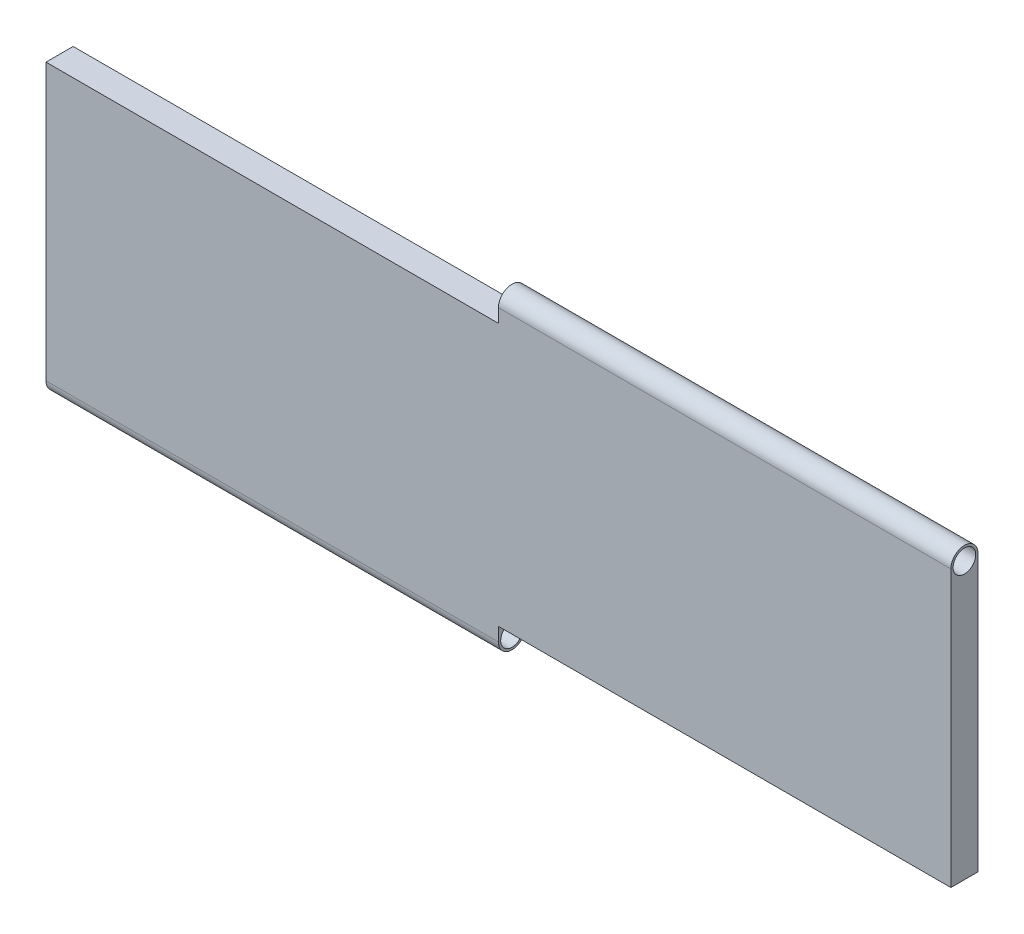
ISO-10303-21;
HEADER;
FILE_DESCRIPTION(('STEP AP214'),'2;1');
FILE_NAME('part.step','',(''),(''),'','','');
FILE_SCHEMA(('AUTOMOTIVE_DESIGN { 1 0 10303 214 1 1 1 1 }'));
ENDSEC;
DATA;
#1=APPLICATION_CONTEXT('core data for automotive mechanical design processes');
#2=APPLICATION_PROTOCOL_DEFINITION('international standard','automotive_design',2000,#1);
#3=PRODUCT_CONTEXT('',#1,'mechanical');
#4=PRODUCT('Part','Part','',(#3));
#5=PRODUCT_RELATED_PRODUCT_CATEGORY('part','',(#4));
#6=PRODUCT_DEFINITION_FORMATION('','',#4);
#7=PRODUCT_DEFINITION_CONTEXT('part definition',#1,'design');
#8=PRODUCT_DEFINITION('design','',#6,#7);
#9=PRODUCT_DEFINITION_SHAPE('','',#8);
#10=(LENGTH_UNIT() NAMED_UNIT(*) SI_UNIT(.MILLI.,.METRE.));
#11=(NAMED_UNIT(*) PLANE_ANGLE_UNIT() SI_UNIT($,.RADIAN.));
#12=(NAMED_UNIT(*) SI_UNIT($,.STERADIAN.) SOLID_ANGLE_UNIT());
#13=UNCERTAINTY_MEASURE_WITH_UNIT(LENGTH_MEASURE(1.E-05),#10,'distance_accuracy_value','');
#14=(GEOMETRIC_REPRESENTATION_CONTEXT(3) GLOBAL_UNCERTAINTY_ASSIGNED_CONTEXT((#13)) GLOBAL_UNIT_ASSIGNED_CONTEXT((#10,
#11,#12)) REPRESENTATION_CONTEXT('',''));
#15=CARTESIAN_POINT('',(0.,0.,0.));
#16=DIRECTION('',(0.,0.,1.));
#17=DIRECTION('',(1.,0.,0.));
#18=AXIS2_PLACEMENT_3D('',#15,#16,#17);
#19=CARTESIAN_POINT('',(-500.,-145.,30.));
#20=DIRECTION('',(0.,1.,0.));
#21=DIRECTION('',(0.,0.,1.));
#22=AXIS2_PLACEMENT_3D('',#19,#20,#21);
#23=PLANE('',#22);
#24=DIRECTION('',(0.,0.,1.));
#25=VECTOR('',#24,1.);
#26=CARTESIAN_POINT('',(0.,-145.,0.));
#27=LINE('',#26,#25);
#28=CARTESIAN_POINT('',(0.,-145.,0.));
#29=VERTEX_POINT('',#28);
#30=CARTESIAN_POINT('',(0.,-145.,30.));
#31=VERTEX_POINT('',#30);
#32=EDGE_CURVE('E51',#29,#31,#27,.T.);
#33=ORIENTED_EDGE('',*,*,#32,.F.);
#34=DIRECTION('',(1.,0.,0.));
#35=VECTOR('',#34,1.);
#36=CARTESIAN_POINT('',(-500.,-145.,0.));
#37=LINE('',#36,#35);
#38=CARTESIAN_POINT('',(500.,-145.,0.));
#39=VERTEX_POINT('',#38);
#40=EDGE_CURVE('E119',#29,#39,#37,.T.);
#41=ORIENTED_EDGE('',*,*,#40,.T.);
#42=DIRECTION('',(0.,0.,-1.));
#43=VECTOR('',#42,1.);
#44=CARTESIAN_POINT('',(500.,-145.,30.));
#45=LINE('',#44,#43);
#46=CARTESIAN_POINT('',(500.,-145.,30.));
#47=VERTEX_POINT('',#46);
#48=EDGE_CURVE('E44',#47,#39,#45,.T.);
#49=ORIENTED_EDGE('',*,*,#48,.F.);
#50=DIRECTION('',(1.,0.,0.));
#51=VECTOR('',#50,1.);
#52=CARTESIAN_POINT('',(-500.,-145.,30.));
#53=LINE('',#52,#51);
#54=EDGE_CURVE('E170',#31,#47,#53,.T.);
#55=ORIENTED_EDGE('',*,*,#54,.F.);
#56=EDGE_LOOP('',(#33,#41,#49,#55));
#57=FACE_BOUND('',#56,.T.);
#58=ADVANCED_FACE('F36',(#57),#23,.F.);
#59=CARTESIAN_POINT('',(-500.,145.,30.));
#60=DIRECTION('',(0.,-1.,0.));
#61=DIRECTION('',(0.,0.,-1.));
#62=AXIS2_PLACEMENT_3D('',#59,#60,#61);
#63=PLANE('',#62);
#64=DIRECTION('',(0.,0.,1.));
#65=VECTOR('',#64,1.);
#66=CARTESIAN_POINT('',(0.,145.,0.));
#67=LINE('',#66,#65);
#68=CARTESIAN_POINT('',(0.,145.,0.));
#69=VERTEX_POINT('',#68);
#70=CARTESIAN_POINT('',(0.,145.,30.));
#71=VERTEX_POINT('',#70);
#72=EDGE_CURVE('E59',#69,#71,#67,.T.);
#73=ORIENTED_EDGE('',*,*,#72,.F.);
#74=DIRECTION('',(-1.,0.,0.));
#75=VECTOR('',#74,1.);
#76=CARTESIAN_POINT('',(-500.,145.,0.));
#77=LINE('',#76,#75);
#78=CARTESIAN_POINT('',(-500.,145.,0.));
#79=VERTEX_POINT('',#78);
#80=EDGE_CURVE('E173',#69,#79,#77,.T.);
#81=ORIENTED_EDGE('',*,*,#80,.T.);
#82=DIRECTION('',(0.,0.,-1.));
#83=VECTOR('',#82,1.);
#84=CARTESIAN_POINT('',(-500.,145.,30.));
#85=LINE('',#84,#83);
#86=CARTESIAN_POINT('',(-500.,145.,30.));
#87=VERTEX_POINT('',#86);
#88=EDGE_CURVE('E11',#87,#79,#85,.T.);
#89=ORIENTED_EDGE('',*,*,#88,.F.);
#90=DIRECTION('',(-1.,0.,0.));
#91=VECTOR('',#90,1.);
#92=CARTESIAN_POINT('',(-500.,145.,30.));
#93=LINE('',#92,#91);
#94=EDGE_CURVE('E166',#71,#87,#93,.T.);
#95=ORIENTED_EDGE('',*,*,#94,.F.);
#96=EDGE_LOOP('',(#73,#81,#89,#95));
#97=FACE_BOUND('',#96,.T.);
#98=ADVANCED_FACE('F206',(#97),#63,.F.);
#99=CARTESIAN_POINT('',(500.,145.,30.));
#100=DIRECTION('',(-1.,0.,0.));
#101=DIRECTION('',(0.,0.,1.));
#102=AXIS2_PLACEMENT_3D('',#99,#100,#101);
#103=PLANE('',#102);
#104=DIRECTION('',(0.,1.,0.));
#105=VECTOR('',#104,1.);
#106=CARTESIAN_POINT('',(500.,145.,0.));
#107=LINE('',#106,#105);
#108=CARTESIAN_POINT('',(500.,160.,0.));
#109=VERTEX_POINT('',#108);
#110=EDGE_CURVE('E161',#39,#109,#107,.T.);
#111=ORIENTED_EDGE('',*,*,#110,.T.);
#112=CARTESIAN_POINT('',(500.,160.,15.));
#113=DIRECTION('',(1.,0.,0.));
#114=DIRECTION('',(0.,0.,-1.));
#115=AXIS2_PLACEMENT_3D('',#112,#113,#114);
#116=CIRCLE('',#115,15.);
#117=CARTESIAN_POINT('',(500.,160.,30.));
#118=VERTEX_POINT('',#117);
#119=EDGE_CURVE('E143',#109,#118,#116,.T.);
#120=ORIENTED_EDGE('',*,*,#119,.T.);
#121=DIRECTION('',(0.,1.,0.));
#122=VECTOR('',#121,1.);
#123=CARTESIAN_POINT('',(500.,145.,30.));
#124=LINE('',#123,#122);
#125=EDGE_CURVE('E164',#47,#118,#124,.T.);
#126=ORIENTED_EDGE('',*,*,#125,.F.);
#127=ORIENTED_EDGE('',*,*,#48,.T.);
#128=EDGE_LOOP('',(#111,#120,#126,#127));
#129=FACE_BOUND('',#128,.T.);
#130=CARTESIAN_POINT('',(500.,160.,15.));
#131=DIRECTION('',(1.,0.,0.));
#132=DIRECTION('',(0.,0.,-1.));
#133=AXIS2_PLACEMENT_3D('',#130,#131,#132);
#134=CIRCLE('',#133,12.5);
#135=CARTESIAN_POINT('',(500.,160.,2.5));
#136=VERTEX_POINT('',#135);
#137=EDGE_CURVE('E137',#136,#136,#134,.T.);
#138=ORIENTED_EDGE('',*,*,#137,.F.);
#139=EDGE_LOOP('',(#138));
#140=FACE_BOUND('',#139,.T.);
#141=ADVANCED_FACE('F38',(#129,#140),#103,.F.);
#142=CARTESIAN_POINT('',(-500.,145.,30.));
#143=DIRECTION('',(1.,0.,0.));
#144=DIRECTION('',(0.,0.,-1.));
#145=AXIS2_PLACEMENT_3D('',#142,#143,#144);
#146=PLANE('',#145);
#147=DIRECTION('',(0.,-1.,0.));
#148=VECTOR('',#147,1.);
#149=CARTESIAN_POINT('',(-500.,145.,0.));
#150=LINE('',#149,#148);
#151=CARTESIAN_POINT('',(-500.,-160.,0.));
#152=VERTEX_POINT('',#151);
#153=EDGE_CURVE('E175',#79,#152,#150,.T.);
#154=ORIENTED_EDGE('',*,*,#153,.T.);
#155=CARTESIAN_POINT('',(-500.,-160.,15.));
#156=DIRECTION('',(-1.,0.,0.));
#157=DIRECTION('',(0.,0.,1.));
#158=AXIS2_PLACEMENT_3D('',#155,#156,#157);
#159=CIRCLE('',#158,15.);
#160=CARTESIAN_POINT('',(-500.,-160.,30.));
#161=VERTEX_POINT('',#160);
#162=EDGE_CURVE('E109',#152,#161,#159,.T.);
#163=ORIENTED_EDGE('',*,*,#162,.T.);
#164=DIRECTION('',(0.,-1.,0.));
#165=VECTOR('',#164,1.);
#166=CARTESIAN_POINT('',(-500.,145.,30.));
#167=LINE('',#166,#165);
#168=EDGE_CURVE('E168',#87,#161,#167,.T.);
#169=ORIENTED_EDGE('',*,*,#168,.F.);
#170=ORIENTED_EDGE('',*,*,#88,.T.);
#171=EDGE_LOOP('',(#154,#163,#169,#170));
#172=FACE_BOUND('',#171,.T.);
#173=CARTESIAN_POINT('',(-500.,-160.,15.));
#174=DIRECTION('',(-1.,0.,0.));
#175=DIRECTION('',(0.,0.,1.));
#176=AXIS2_PLACEMENT_3D('',#173,#174,#175);
#177=CIRCLE('',#176,12.5);
#178=CARTESIAN_POINT('',(-500.,-160.,27.5));
#179=VERTEX_POINT('',#178);
#180=EDGE_CURVE('E121',#179,#179,#177,.T.);
#181=ORIENTED_EDGE('',*,*,#180,.F.);
#182=EDGE_LOOP('',(#181));
#183=FACE_BOUND('',#182,.T.);
#184=ADVANCED_FACE('F214',(#172,#183),#146,.F.);
#185=CARTESIAN_POINT('',(0.,0.,30.));
#186=DIRECTION('',(0.,0.,1.));
#187=DIRECTION('',(1.,0.,0.));
#188=AXIS2_PLACEMENT_3D('',#185,#186,#187);
#189=PLANE('',#188);
#190=ORIENTED_EDGE('',*,*,#125,.T.);
#191=DIRECTION('',(1.,0.,0.));
#192=VECTOR('',#191,1.);
#193=CARTESIAN_POINT('',(0.,160.,30.));
#194=LINE('',#193,#192);
#195=CARTESIAN_POINT('',(0.,160.,30.));
#196=VERTEX_POINT('',#195);
#197=EDGE_CURVE('E153',#196,#118,#194,.T.);
#198=ORIENTED_EDGE('',*,*,#197,.F.);
#199=DIRECTION('',(0.,-1.,0.));
#200=VECTOR('',#199,1.);
#201=CARTESIAN_POINT('',(0.,0.,29.9999999999999));
#202=LINE('',#201,#200);
#203=EDGE_CURVE('E146',#196,#71,#202,.T.);
#204=ORIENTED_EDGE('',*,*,#203,.T.);
#205=ORIENTED_EDGE('',*,*,#94,.T.);
#206=ORIENTED_EDGE('',*,*,#168,.T.);
#207=DIRECTION('',(-1.,0.,0.));
#208=VECTOR('',#207,1.);
#209=CARTESIAN_POINT('',(0.,-160.,30.));
#210=LINE('',#209,#208);
#211=CARTESIAN_POINT('',(0.,-160.,30.));
#212=VERTEX_POINT('',#211);
#213=EDGE_CURVE('E112',#212,#161,#210,.T.);
#214=ORIENTED_EDGE('',*,*,#213,.F.);
#215=DIRECTION('',(0.,1.,0.));
#216=VECTOR('',#215,1.);
#217=CARTESIAN_POINT('',(0.,0.,30.));
#218=LINE('',#217,#216);
#219=EDGE_CURVE('E127',#212,#31,#218,.T.);
#220=ORIENTED_EDGE('',*,*,#219,.T.);
#221=ORIENTED_EDGE('',*,*,#54,.T.);
#222=EDGE_LOOP('',(#190,#198,#204,#205,#206,#214,#220,#221));
#223=FACE_BOUND('',#222,.T.);
#224=ADVANCED_FACE('F189',(#223),#189,.T.);
#225=CARTESIAN_POINT('',(0.,0.,0.));
#226=DIRECTION('',(0.,0.,1.));
#227=DIRECTION('',(1.,0.,0.));
#228=AXIS2_PLACEMENT_3D('',#225,#226,#227);
#229=PLANE('',#228);
#230=ORIENTED_EDGE('',*,*,#110,.F.);
#231=ORIENTED_EDGE('',*,*,#40,.F.);
#232=DIRECTION('',(0.,1.,0.));
#233=VECTOR('',#232,1.);
#234=CARTESIAN_POINT('',(0.,0.,0.));
#235=LINE('',#234,#233);
#236=CARTESIAN_POINT('',(0.,-160.,0.));
#237=VERTEX_POINT('',#236);
#238=EDGE_CURVE('E116',#237,#29,#235,.T.);
#239=ORIENTED_EDGE('',*,*,#238,.F.);
#240=DIRECTION('',(-1.,0.,0.));
#241=VECTOR('',#240,1.);
#242=CARTESIAN_POINT('',(0.,-160.,0.));
#243=LINE('',#242,#241);
#244=EDGE_CURVE('E102',#237,#152,#243,.T.);
#245=ORIENTED_EDGE('',*,*,#244,.T.);
#246=ORIENTED_EDGE('',*,*,#153,.F.);
#247=ORIENTED_EDGE('',*,*,#80,.F.);
#248=DIRECTION('',(0.,-1.,0.));
#249=VECTOR('',#248,1.);
#250=CARTESIAN_POINT('',(0.,0.,0.));
#251=LINE('',#250,#249);
#252=CARTESIAN_POINT('',(0.,160.,0.));
#253=VERTEX_POINT('',#252);
#254=EDGE_CURVE('E150',#253,#69,#251,.T.);
#255=ORIENTED_EDGE('',*,*,#254,.F.);
#256=DIRECTION('',(1.,0.,0.));
#257=VECTOR('',#256,1.);
#258=CARTESIAN_POINT('',(0.,160.,0.));
#259=LINE('',#258,#257);
#260=EDGE_CURVE('E158',#253,#109,#259,.T.);
#261=ORIENTED_EDGE('',*,*,#260,.T.);
#262=EDGE_LOOP('',(#230,#231,#239,#245,#246,#247,#255,#261));
#263=FACE_BOUND('',#262,.T.);
#264=ADVANCED_FACE('F118',(#263),#229,.F.);
#265=CARTESIAN_POINT('',(0.,160.,15.));
#266=DIRECTION('',(1.,0.,0.));
#267=DIRECTION('',(0.,0.,-1.));
#268=AXIS2_PLACEMENT_3D('',#265,#266,#267);
#269=CYLINDRICAL_SURFACE('',#268,15.);
#270=ORIENTED_EDGE('',*,*,#119,.F.);
#271=ORIENTED_EDGE('',*,*,#260,.F.);
#272=CARTESIAN_POINT('',(0.,160.,15.));
#273=DIRECTION('',(1.,0.,0.));
#274=DIRECTION('',(0.,0.,-1.));
#275=AXIS2_PLACEMENT_3D('',#272,#273,#274);
#276=CIRCLE('',#275,15.);
#277=EDGE_CURVE('E142',#253,#196,#276,.T.);
#278=ORIENTED_EDGE('',*,*,#277,.T.);
#279=ORIENTED_EDGE('',*,*,#197,.T.);
#280=EDGE_LOOP('',(#270,#271,#278,#279));
#281=FACE_BOUND('',#280,.T.);
#282=ADVANCED_FACE('F186',(#281),#269,.T.);
#283=CARTESIAN_POINT('',(0.,160.,15.));
#284=DIRECTION('',(1.,0.,0.));
#285=DIRECTION('',(0.,0.,-1.));
#286=AXIS2_PLACEMENT_3D('',#283,#284,#285);
#287=CYLINDRICAL_SURFACE('',#286,12.5);
#288=CARTESIAN_POINT('',(0.,160.,15.));
#289=DIRECTION('',(1.,0.,0.));
#290=DIRECTION('',(0.,0.,-1.));
#291=AXIS2_PLACEMENT_3D('',#288,#289,#290);
#292=CIRCLE('',#291,12.5);
#293=CARTESIAN_POINT('',(0.,160.,2.5));
#294=VERTEX_POINT('',#293);
#295=EDGE_CURVE('E139',#294,#294,#292,.T.);
#296=ORIENTED_EDGE('',*,*,#295,.F.);
#297=EDGE_LOOP('',(#296));
#298=FACE_BOUND('',#297,.T.);
#299=ORIENTED_EDGE('',*,*,#137,.T.);
#300=EDGE_LOOP('',(#299));
#301=FACE_BOUND('',#300,.T.);
#302=ADVANCED_FACE('F193',(#298,#301),#287,.F.);
#303=CARTESIAN_POINT('',(0.,0.,0.));
#304=DIRECTION('',(1.,0.,0.));
#305=DIRECTION('',(0.,0.,-1.));
#306=AXIS2_PLACEMENT_3D('',#303,#304,#305);
#307=PLANE('',#306);
#308=ORIENTED_EDGE('',*,*,#295,.T.);
#309=EDGE_LOOP('',(#308));
#310=FACE_BOUND('',#309,.T.);
#311=ORIENTED_EDGE('',*,*,#277,.F.);
#312=ORIENTED_EDGE('',*,*,#254,.T.);
#313=ORIENTED_EDGE('',*,*,#72,.T.);
#314=ORIENTED_EDGE('',*,*,#203,.F.);
#315=EDGE_LOOP('',(#311,#312,#313,#314));
#316=FACE_BOUND('',#315,.T.);
#317=ADVANCED_FACE('F191',(#310,#316),#307,.F.);
#318=CARTESIAN_POINT('',(0.,-160.,15.));
#319=DIRECTION('',(-1.,0.,0.));
#320=DIRECTION('',(0.,0.,1.));
#321=AXIS2_PLACEMENT_3D('',#318,#319,#320);
#322=CYLINDRICAL_SURFACE('',#321,15.);
#323=ORIENTED_EDGE('',*,*,#162,.F.);
#324=ORIENTED_EDGE('',*,*,#244,.F.);
#325=CARTESIAN_POINT('',(0.,-160.,15.));
#326=DIRECTION('',(-1.,0.,0.));
#327=DIRECTION('',(0.,0.,1.));
#328=AXIS2_PLACEMENT_3D('',#325,#326,#327);
#329=CIRCLE('',#328,15.);
#330=EDGE_CURVE('E107',#237,#212,#329,.T.);
#331=ORIENTED_EDGE('',*,*,#330,.T.);
#332=ORIENTED_EDGE('',*,*,#213,.T.);
#333=EDGE_LOOP('',(#323,#324,#331,#332));
#334=FACE_BOUND('',#333,.T.);
#335=ADVANCED_FACE('F104',(#334),#322,.T.);
#336=CARTESIAN_POINT('',(0.,-160.,15.));
#337=DIRECTION('',(-1.,0.,0.));
#338=DIRECTION('',(0.,0.,1.));
#339=AXIS2_PLACEMENT_3D('',#336,#337,#338);
#340=CYLINDRICAL_SURFACE('',#339,12.5);
#341=CARTESIAN_POINT('',(0.,-160.,15.));
#342=DIRECTION('',(-1.,0.,0.));
#343=DIRECTION('',(0.,0.,1.));
#344=AXIS2_PLACEMENT_3D('',#341,#342,#343);
#345=CIRCLE('',#344,12.5);
#346=CARTESIAN_POINT('',(0.,-160.,27.5));
#347=VERTEX_POINT('',#346);
#348=EDGE_CURVE('E113',#347,#347,#345,.T.);
#349=ORIENTED_EDGE('',*,*,#348,.F.);
#350=EDGE_LOOP('',(#349));
#351=FACE_BOUND('',#350,.T.);
#352=ORIENTED_EDGE('',*,*,#180,.T.);
#353=EDGE_LOOP('',(#352));
#354=FACE_BOUND('',#353,.T.);
#355=ADVANCED_FACE('F200',(#351,#354),#340,.F.);
#356=CARTESIAN_POINT('',(0.,0.,0.));
#357=DIRECTION('',(-1.,0.,0.));
#358=DIRECTION('',(0.,0.,1.));
#359=AXIS2_PLACEMENT_3D('',#356,#357,#358);
#360=PLANE('',#359);
#361=ORIENTED_EDGE('',*,*,#238,.T.);
#362=ORIENTED_EDGE('',*,*,#32,.T.);
#363=ORIENTED_EDGE('',*,*,#219,.F.);
#364=ORIENTED_EDGE('',*,*,#330,.F.);
#365=EDGE_LOOP('',(#361,#362,#363,#364));
#366=FACE_BOUND('',#365,.T.);
#367=ORIENTED_EDGE('',*,*,#348,.T.);
#368=EDGE_LOOP('',(#367));
#369=FACE_BOUND('',#368,.T.);
#370=ADVANCED_FACE('F124',(#366,#369),#360,.F.);
#371=CLOSED_SHELL('',(#58,#98,#141,#184,#224,#264,#282,#302,#317,#335,#355,#370));
#372=MANIFOLD_SOLID_BREP('B2',#371);
#373=ADVANCED_BREP_SHAPE_REPRESENTATION('',(#18,#372),#14);
#374=SHAPE_DEFINITION_REPRESENTATION(#9,#373);
ENDSEC;
END-ISO-10303-21;
